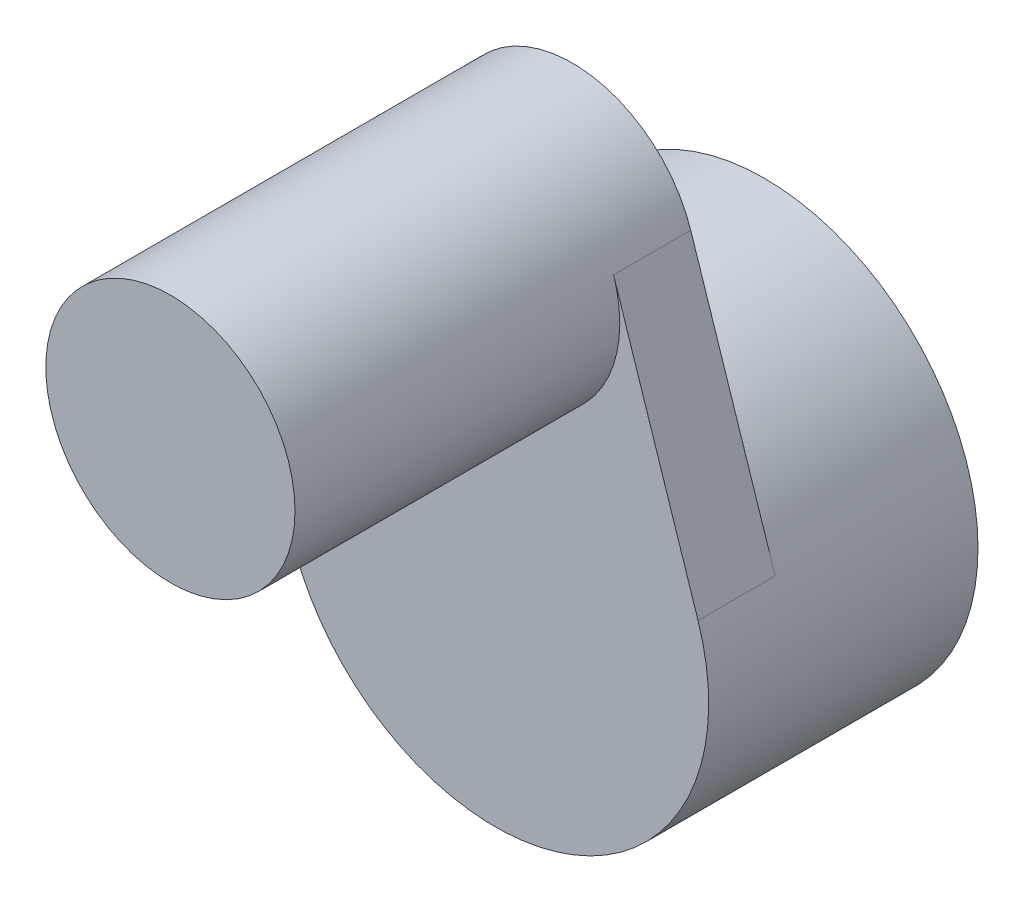
ISO-10303-21;
HEADER;
FILE_DESCRIPTION(('STEP AP214'),'2;1');
FILE_NAME('part.step','',(''),(''),'','','');
FILE_SCHEMA(('AUTOMOTIVE_DESIGN { 1 0 10303 214 1 1 1 1 }'));
ENDSEC;
DATA;
#1=APPLICATION_CONTEXT('core data for automotive mechanical design processes');
#2=APPLICATION_PROTOCOL_DEFINITION('international standard','automotive_design',2000,#1);
#3=PRODUCT_CONTEXT('',#1,'mechanical');
#4=PRODUCT('Part','Part','',(#3));
#5=PRODUCT_RELATED_PRODUCT_CATEGORY('part','',(#4));
#6=PRODUCT_DEFINITION_FORMATION('','',#4);
#7=PRODUCT_DEFINITION_CONTEXT('part definition',#1,'design');
#8=PRODUCT_DEFINITION('design','',#6,#7);
#9=PRODUCT_DEFINITION_SHAPE('','',#8);
#10=(LENGTH_UNIT() NAMED_UNIT(*) SI_UNIT(.MILLI.,.METRE.));
#11=(NAMED_UNIT(*) PLANE_ANGLE_UNIT() SI_UNIT($,.RADIAN.));
#12=(NAMED_UNIT(*) SI_UNIT($,.STERADIAN.) SOLID_ANGLE_UNIT());
#13=UNCERTAINTY_MEASURE_WITH_UNIT(LENGTH_MEASURE(1.E-05),#10,'distance_accuracy_value','');
#14=(GEOMETRIC_REPRESENTATION_CONTEXT(3) GLOBAL_UNCERTAINTY_ASSIGNED_CONTEXT((#13)) GLOBAL_UNIT_ASSIGNED_CONTEXT((#10,
#11,#12)) REPRESENTATION_CONTEXT('',''));
#15=CARTESIAN_POINT('',(0.,0.,0.));
#16=DIRECTION('',(0.,0.,1.));
#17=DIRECTION('',(1.,0.,0.));
#18=AXIS2_PLACEMENT_3D('',#15,#16,#17);
#19=CARTESIAN_POINT('',(0.,0.,4.2545));
#20=DIRECTION('',(0.,0.,-1.));
#21=DIRECTION('',(-1.,0.,0.));
#22=AXIS2_PLACEMENT_3D('',#19,#20,#21);
#23=CYLINDRICAL_SURFACE('',#22,2.33426);
#24=CARTESIAN_POINT('',(0.,0.,0.));
#25=DIRECTION('',(0.,0.,1.));
#26=DIRECTION('',(1.,0.,0.));
#27=AXIS2_PLACEMENT_3D('',#24,#25,#26);
#28=CIRCLE('',#27,2.33426);
#29=CARTESIAN_POINT('',(2.33426,0.,0.));
#30=VERTEX_POINT('',#29);
#31=EDGE_CURVE('E103',#30,#30,#28,.T.);
#32=ORIENTED_EDGE('',*,*,#31,.F.);
#33=EDGE_LOOP('',(#32));
#34=FACE_BOUND('',#33,.T.);
#35=CARTESIAN_POINT('',(0.,0.,2.6924));
#36=DIRECTION('',(0.,0.,1.));
#37=DIRECTION('',(1.,0.,0.));
#38=AXIS2_PLACEMENT_3D('',#35,#36,#37);
#39=CIRCLE('',#38,2.33426);
#40=CARTESIAN_POINT('',(2.33426,0.,2.6924));
#41=VERTEX_POINT('',#40);
#42=EDGE_CURVE('E108',#41,#41,#39,.F.);
#43=ORIENTED_EDGE('',*,*,#42,.F.);
#44=EDGE_LOOP('',(#43));
#45=FACE_BOUND('',#44,.T.);
#46=ADVANCED_FACE('F37',(#34,#45),#23,.F.);
#47=CARTESIAN_POINT('',(0.,0.,4.2545));
#48=DIRECTION('',(0.,0.,1.));
#49=DIRECTION('',(1.,0.,0.));
#50=AXIS2_PLACEMENT_3D('',#47,#48,#49);
#51=PLANE('',#50);
#52=CARTESIAN_POINT('',(0.,4.5,4.2545));
#53=DIRECTION('',(0.,0.,1.));
#54=DIRECTION('',(1.,0.,0.));
#55=AXIS2_PLACEMENT_3D('',#52,#53,#54);
#56=CIRCLE('',#55,1.9685);
#57=CARTESIAN_POINT('',(-1.87014753023866,5.11444321555556,4.2545));
#58=VERTEX_POINT('',#57);
#59=CARTESIAN_POINT('',(1.87014753023866,5.11444321555556,4.2545));
#60=VERTEX_POINT('',#59);
#61=EDGE_CURVE('E12',#58,#60,#56,.T.);
#62=ORIENTED_EDGE('',*,*,#61,.F.);
#63=DIRECTION('',(-0.312137777777778,-0.950036845434929,0.));
#64=VECTOR('',#63,1.);
#65=CARTESIAN_POINT('',(-3.20458828407347,1.05287818097778,4.2545));
#66=LINE('',#65,#64);
#67=CARTESIAN_POINT('',(-3.20458828407347,1.05287818097778,4.2545));
#68=VERTEX_POINT('',#67);
#69=EDGE_CURVE('E54',#58,#68,#66,.T.);
#70=ORIENTED_EDGE('',*,*,#69,.T.);
#71=CARTESIAN_POINT('',(0.,0.,4.2545));
#72=DIRECTION('',(0.,0.,1.));
#73=DIRECTION('',(1.,0.,0.));
#74=AXIS2_PLACEMENT_3D('',#71,#72,#73);
#75=CIRCLE('',#74,3.37312);
#76=CARTESIAN_POINT('',(3.20458828407347,1.05287818097778,4.2545));
#77=VERTEX_POINT('',#76);
#78=EDGE_CURVE('E46',#68,#77,#75,.T.);
#79=ORIENTED_EDGE('',*,*,#78,.T.);
#80=DIRECTION('',(0.312137777777778,-0.950036845434929,0.));
#81=VECTOR('',#80,1.);
#82=CARTESIAN_POINT('',(3.20458828407347,1.05287818097778,4.2545));
#83=LINE('',#82,#81);
#84=EDGE_CURVE('E82',#60,#77,#83,.T.);
#85=ORIENTED_EDGE('',*,*,#84,.F.);
#86=EDGE_LOOP('',(#62,#70,#79,#85));
#87=FACE_BOUND('',#86,.T.);
#88=ADVANCED_FACE('F84',(#87),#51,.T.);
#89=CARTESIAN_POINT('',(0.,0.,0.));
#90=DIRECTION('',(0.,0.,1.));
#91=DIRECTION('',(1.,0.,0.));
#92=AXIS2_PLACEMENT_3D('',#89,#90,#91);
#93=PLANE('',#92);
#94=CARTESIAN_POINT('',(0.,0.,0.));
#95=DIRECTION('',(0.,0.,1.));
#96=DIRECTION('',(1.,0.,0.));
#97=AXIS2_PLACEMENT_3D('',#94,#95,#96);
#98=CIRCLE('',#97,3.37312);
#99=CARTESIAN_POINT('',(3.37312,0.,0.));
#100=VERTEX_POINT('',#99);
#101=EDGE_CURVE('E119',#100,#100,#98,.T.);
#102=ORIENTED_EDGE('',*,*,#101,.F.);
#103=EDGE_LOOP('',(#102));
#104=FACE_BOUND('',#103,.T.);
#105=ORIENTED_EDGE('',*,*,#31,.T.);
#106=EDGE_LOOP('',(#105));
#107=FACE_BOUND('',#106,.T.);
#108=ADVANCED_FACE('F159',(#104,#107),#93,.F.);
#109=CARTESIAN_POINT('',(0.,0.,4.2545));
#110=DIRECTION('',(0.,0.,-1.));
#111=DIRECTION('',(-1.,0.,0.));
#112=AXIS2_PLACEMENT_3D('',#109,#110,#111);
#113=CYLINDRICAL_SURFACE('',#112,3.37312);
#114=ORIENTED_EDGE('',*,*,#78,.F.);
#115=DIRECTION('',(0.,0.,1.));
#116=VECTOR('',#115,1.);
#117=CARTESIAN_POINT('',(-3.20458828407347,1.05287818097778,3.0353));
#118=LINE('',#117,#116);
#119=CARTESIAN_POINT('',(-3.20458828407347,1.05287818097778,3.0353));
#120=VERTEX_POINT('',#119);
#121=EDGE_CURVE('E107',#120,#68,#118,.T.);
#122=ORIENTED_EDGE('',*,*,#121,.F.);
#123=CARTESIAN_POINT('',(0.,0.,3.0353));
#124=DIRECTION('',(0.,0.,1.));
#125=DIRECTION('',(1.,0.,0.));
#126=AXIS2_PLACEMENT_3D('',#123,#124,#125);
#127=CIRCLE('',#126,3.37312);
#128=CARTESIAN_POINT('',(3.20458828407347,1.05287818097778,3.0353));
#129=VERTEX_POINT('',#128);
#130=EDGE_CURVE('E80',#129,#120,#127,.T.);
#131=ORIENTED_EDGE('',*,*,#130,.F.);
#132=DIRECTION('',(0.,0.,1.));
#133=VECTOR('',#132,1.);
#134=CARTESIAN_POINT('',(3.20458828407347,1.05287818097778,3.0353));
#135=LINE('',#134,#133);
#136=EDGE_CURVE('E98',#129,#77,#135,.T.);
#137=ORIENTED_EDGE('',*,*,#136,.T.);
#138=EDGE_LOOP('',(#114,#122,#131,#137));
#139=FACE_BOUND('',#138,.T.);
#140=ORIENTED_EDGE('',*,*,#101,.T.);
#141=EDGE_LOOP('',(#140));
#142=FACE_BOUND('',#141,.T.);
#143=ADVANCED_FACE('F39',(#139,#142),#113,.T.);
#144=CARTESIAN_POINT('',(-3.20458828407347,1.05287818097778,3.0353));
#145=DIRECTION('',(-0.950036845434929,0.312137777777778,0.));
#146=DIRECTION('',(-0.312137777777778,-0.950036845434929,0.));
#147=AXIS2_PLACEMENT_3D('',#144,#145,#146);
#148=PLANE('',#147);
#149=ORIENTED_EDGE('',*,*,#69,.F.);
#150=DIRECTION('',(0.,0.,1.));
#151=VECTOR('',#150,1.);
#152=CARTESIAN_POINT('',(-1.87014753023866,5.11444321555556,3.0353));
#153=LINE('',#152,#151);
#154=CARTESIAN_POINT('',(-1.87014753023866,5.11444321555556,3.0353));
#155=VERTEX_POINT('',#154);
#156=EDGE_CURVE('E62',#155,#58,#153,.T.);
#157=ORIENTED_EDGE('',*,*,#156,.F.);
#158=DIRECTION('',(-0.312137777777778,-0.950036845434929,0.));
#159=VECTOR('',#158,1.);
#160=CARTESIAN_POINT('',(-3.20458828407347,1.05287818097778,3.0353));
#161=LINE('',#160,#159);
#162=EDGE_CURVE('E89',#155,#120,#161,.T.);
#163=ORIENTED_EDGE('',*,*,#162,.T.);
#164=ORIENTED_EDGE('',*,*,#121,.T.);
#165=EDGE_LOOP('',(#149,#157,#163,#164));
#166=FACE_BOUND('',#165,.T.);
#167=ADVANCED_FACE('F105',(#166),#148,.T.);
#168=CARTESIAN_POINT('',(0.,4.5,3.0353));
#169=DIRECTION('',(0.,0.,1.));
#170=DIRECTION('',(1.,0.,0.));
#171=AXIS2_PLACEMENT_3D('',#168,#169,#170);
#172=CYLINDRICAL_SURFACE('',#171,1.9685);
#173=ORIENTED_EDGE('',*,*,#156,.T.);
#174=ORIENTED_EDGE('',*,*,#61,.T.);
#175=DIRECTION('',(0.,0.,1.));
#176=VECTOR('',#175,1.);
#177=CARTESIAN_POINT('',(1.87014753023866,5.11444321555556,3.0353));
#178=LINE('',#177,#176);
#179=CARTESIAN_POINT('',(1.87014753023866,5.11444321555556,3.0353));
#180=VERTEX_POINT('',#179);
#181=EDGE_CURVE('E92',#180,#60,#178,.T.);
#182=ORIENTED_EDGE('',*,*,#181,.F.);
#183=CARTESIAN_POINT('',(0.,4.5,3.0353));
#184=DIRECTION('',(0.,0.,1.));
#185=DIRECTION('',(1.,0.,0.));
#186=AXIS2_PLACEMENT_3D('',#183,#184,#185);
#187=CIRCLE('',#186,1.9685);
#188=EDGE_CURVE('E102',#180,#155,#187,.T.);
#189=ORIENTED_EDGE('',*,*,#188,.T.);
#190=EDGE_LOOP('',(#173,#174,#182,#189));
#191=FACE_BOUND('',#190,.T.);
#192=CARTESIAN_POINT('',(0.,4.5,9.3853));
#193=DIRECTION('',(0.,0.,1.));
#194=DIRECTION('',(1.,0.,0.));
#195=AXIS2_PLACEMENT_3D('',#192,#193,#194);
#196=CIRCLE('',#195,1.9685);
#197=CARTESIAN_POINT('',(1.9685,4.5,9.3853));
#198=VERTEX_POINT('',#197);
#199=EDGE_CURVE('E132',#198,#198,#196,.T.);
#200=ORIENTED_EDGE('',*,*,#199,.F.);
#201=EDGE_LOOP('',(#200));
#202=FACE_BOUND('',#201,.T.);
#203=ADVANCED_FACE('F100',(#191,#202),#172,.T.);
#204=CARTESIAN_POINT('',(3.20458828407347,1.05287818097778,3.0353));
#205=DIRECTION('',(-0.950036845434929,-0.312137777777778,0.));
#206=DIRECTION('',(0.312137777777778,-0.950036845434929,0.));
#207=AXIS2_PLACEMENT_3D('',#204,#205,#206);
#208=PLANE('',#207);
#209=ORIENTED_EDGE('',*,*,#84,.T.);
#210=ORIENTED_EDGE('',*,*,#136,.F.);
#211=DIRECTION('',(0.312137777777778,-0.950036845434929,0.));
#212=VECTOR('',#211,1.);
#213=CARTESIAN_POINT('',(3.20458828407347,1.05287818097778,3.0353));
#214=LINE('',#213,#212);
#215=EDGE_CURVE('E94',#180,#129,#214,.T.);
#216=ORIENTED_EDGE('',*,*,#215,.F.);
#217=ORIENTED_EDGE('',*,*,#181,.T.);
#218=EDGE_LOOP('',(#209,#210,#216,#217));
#219=FACE_BOUND('',#218,.T.);
#220=ADVANCED_FACE('F93',(#219),#208,.F.);
#221=CARTESIAN_POINT('',(0.,4.5,3.0353));
#222=DIRECTION('',(0.,0.,1.));
#223=DIRECTION('',(1.,0.,0.));
#224=AXIS2_PLACEMENT_3D('',#221,#222,#223);
#225=CYLINDRICAL_SURFACE('',#224,0.4699);
#226=CARTESIAN_POINT('',(0.,4.5,3.0353));
#227=DIRECTION('',(0.,0.,1.));
#228=DIRECTION('',(1.,0.,0.));
#229=AXIS2_PLACEMENT_3D('',#226,#227,#228);
#230=CIRCLE('',#229,0.4699);
#231=CARTESIAN_POINT('',(0.4699,4.5,3.0353));
#232=VERTEX_POINT('',#231);
#233=EDGE_CURVE('E128',#232,#232,#230,.T.);
#234=ORIENTED_EDGE('',*,*,#233,.F.);
#235=EDGE_LOOP('',(#234));
#236=FACE_BOUND('',#235,.T.);
#237=CARTESIAN_POINT('',(0.,4.5,4.2545));
#238=DIRECTION('',(0.,0.,1.));
#239=DIRECTION('',(1.,0.,0.));
#240=AXIS2_PLACEMENT_3D('',#237,#238,#239);
#241=CIRCLE('',#240,0.4699);
#242=CARTESIAN_POINT('',(0.4699,4.5,4.2545));
#243=VERTEX_POINT('',#242);
#244=EDGE_CURVE('E110',#243,#243,#241,.T.);
#245=ORIENTED_EDGE('',*,*,#244,.T.);
#246=EDGE_LOOP('',(#245));
#247=FACE_BOUND('',#246,.T.);
#248=ADVANCED_FACE('F149',(#236,#247),#225,.F.);
#249=CARTESIAN_POINT('',(0.,0.,3.0353));
#250=DIRECTION('',(0.,0.,1.));
#251=DIRECTION('',(1.,0.,0.));
#252=AXIS2_PLACEMENT_3D('',#249,#250,#251);
#253=PLANE('',#252);
#254=ORIENTED_EDGE('',*,*,#162,.F.);
#255=ORIENTED_EDGE('',*,*,#188,.F.);
#256=ORIENTED_EDGE('',*,*,#215,.T.);
#257=ORIENTED_EDGE('',*,*,#130,.T.);
#258=EDGE_LOOP('',(#254,#255,#256,#257));
#259=FACE_BOUND('',#258,.T.);
#260=ORIENTED_EDGE('',*,*,#233,.T.);
#261=EDGE_LOOP('',(#260));
#262=FACE_BOUND('',#261,.T.);
#263=ADVANCED_FACE('F225',(#259,#262),#253,.F.);
#264=CARTESIAN_POINT('',(0.,0.,2.6924));
#265=DIRECTION('',(0.,0.,1.));
#266=DIRECTION('',(1.,0.,0.));
#267=AXIS2_PLACEMENT_3D('',#264,#265,#266);
#268=PLANE('',#267);
#269=ORIENTED_EDGE('',*,*,#42,.T.);
#270=EDGE_LOOP('',(#269));
#271=FACE_BOUND('',#270,.T.);
#272=ADVANCED_FACE('F208',(#271),#268,.F.);
#273=CARTESIAN_POINT('',(0.,0.,9.3853));
#274=DIRECTION('',(0.,0.,1.));
#275=DIRECTION('',(1.,0.,0.));
#276=AXIS2_PLACEMENT_3D('',#273,#274,#275);
#277=PLANE('',#276);
#278=ORIENTED_EDGE('',*,*,#199,.T.);
#279=EDGE_LOOP('',(#278));
#280=FACE_BOUND('',#279,.T.);
#281=ADVANCED_FACE('F142',(#280),#277,.T.);
#282=CARTESIAN_POINT('',(0.,4.5,4.2545));
#283=DIRECTION('',(0.,0.,1.));
#284=DIRECTION('',(1.,0.,0.));
#285=AXIS2_PLACEMENT_3D('',#282,#283,#284);
#286=PLANE('',#285);
#287=ORIENTED_EDGE('',*,*,#244,.F.);
#288=EDGE_LOOP('',(#287));
#289=FACE_BOUND('',#288,.T.);
#290=ADVANCED_FACE('F207',(#289),#286,.F.);
#291=CLOSED_SHELL('',(#46,#88,#108,#143,#167,#203,#220,#248,#263,#272,#281,#290));
#292=MANIFOLD_SOLID_BREP('B2',#291);
#293=ADVANCED_BREP_SHAPE_REPRESENTATION('',(#18,#292),#14);
#294=SHAPE_DEFINITION_REPRESENTATION(#9,#293);
ENDSEC;
END-ISO-10303-21;
